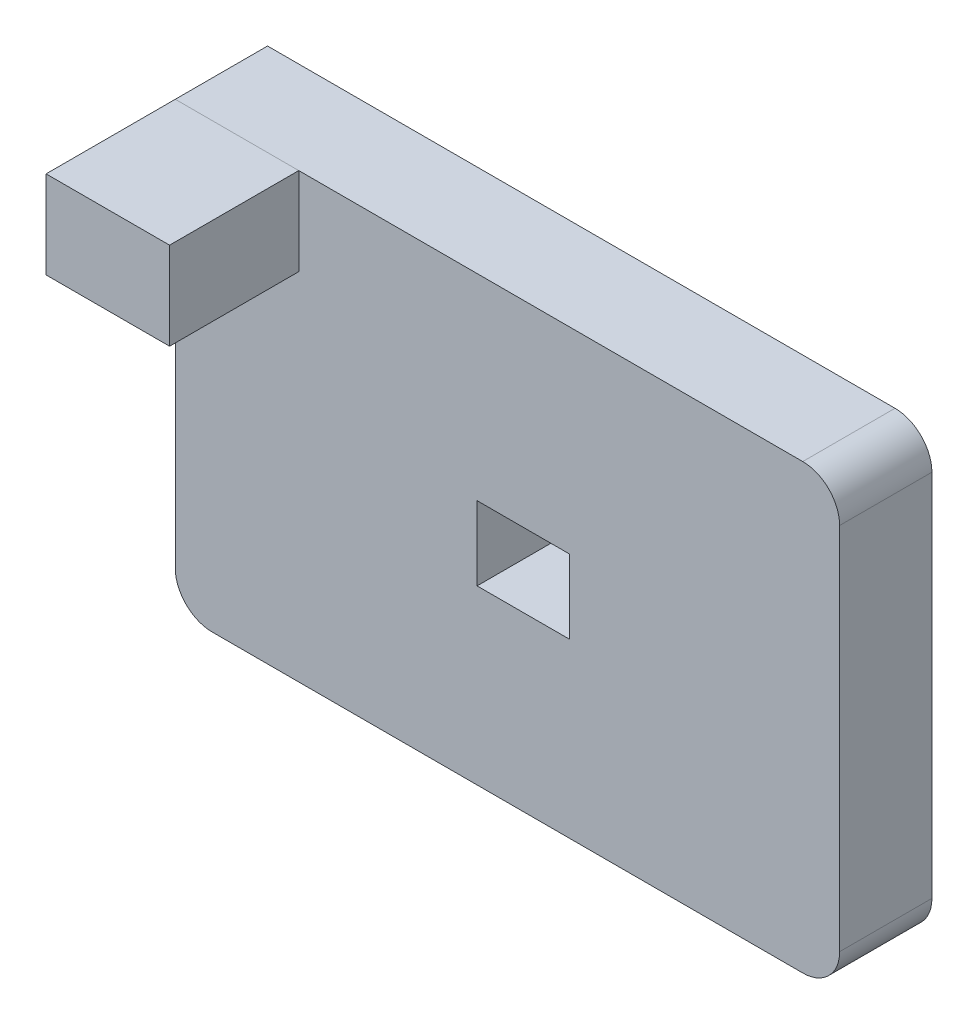
ISO-10303-21;
HEADER;
FILE_DESCRIPTION(('STEP AP214'),'2;1');
FILE_NAME('part.step','',(''),(''),'','','');
FILE_SCHEMA(('AUTOMOTIVE_DESIGN { 1 0 10303 214 1 1 1 1 }'));
ENDSEC;
DATA;
#1=APPLICATION_CONTEXT('core data for automotive mechanical design processes');
#2=APPLICATION_PROTOCOL_DEFINITION('international standard','automotive_design',2000,#1);
#3=PRODUCT_CONTEXT('',#1,'mechanical');
#4=PRODUCT('Part','Part','',(#3));
#5=PRODUCT_RELATED_PRODUCT_CATEGORY('part','',(#4));
#6=PRODUCT_DEFINITION_FORMATION('','',#4);
#7=PRODUCT_DEFINITION_CONTEXT('part definition',#1,'design');
#8=PRODUCT_DEFINITION('design','',#6,#7);
#9=PRODUCT_DEFINITION_SHAPE('','',#8);
#10=(LENGTH_UNIT() NAMED_UNIT(*) SI_UNIT(.MILLI.,.METRE.));
#11=(NAMED_UNIT(*) PLANE_ANGLE_UNIT() SI_UNIT($,.RADIAN.));
#12=(NAMED_UNIT(*) SI_UNIT($,.STERADIAN.) SOLID_ANGLE_UNIT());
#13=UNCERTAINTY_MEASURE_WITH_UNIT(LENGTH_MEASURE(1.E-05),#10,'distance_accuracy_value','');
#14=(GEOMETRIC_REPRESENTATION_CONTEXT(3) GLOBAL_UNCERTAINTY_ASSIGNED_CONTEXT((#13)) GLOBAL_UNIT_ASSIGNED_CONTEXT((#10,
#11,#12)) REPRESENTATION_CONTEXT('',''));
#15=CARTESIAN_POINT('',(0.,0.,0.));
#16=DIRECTION('',(0.,0.,1.));
#17=DIRECTION('',(1.,0.,0.));
#18=AXIS2_PLACEMENT_3D('',#15,#16,#17);
#19=CARTESIAN_POINT('',(0.,120.,60.));
#20=DIRECTION('',(1.,0.,0.));
#21=DIRECTION('',(0.,0.,-1.));
#22=AXIS2_PLACEMENT_3D('',#19,#20,#21);
#23=PLANE('',#22);
#24=DIRECTION('',(0.,-1.,0.));
#25=VECTOR('',#24,1.);
#26=CARTESIAN_POINT('',(0.,120.,25.));
#27=LINE('',#26,#25);
#28=CARTESIAN_POINT('',(0.,120.,25.));
#29=VERTEX_POINT('',#28);
#30=CARTESIAN_POINT('',(0.,96.2812155250226,25.));
#31=VERTEX_POINT('',#30);
#32=EDGE_CURVE('E136',#29,#31,#27,.T.);
#33=ORIENTED_EDGE('',*,*,#32,.T.);
#34=DIRECTION('',(0.,0.,-1.));
#35=VECTOR('',#34,1.);
#36=CARTESIAN_POINT('',(0.,96.2812155250226,60.));
#37=LINE('',#36,#35);
#38=CARTESIAN_POINT('',(0.,96.2812155250226,60.));
#39=VERTEX_POINT('',#38);
#40=EDGE_CURVE('E13',#39,#31,#37,.T.);
#41=ORIENTED_EDGE('',*,*,#40,.F.);
#42=DIRECTION('',(0.,-1.,0.));
#43=VECTOR('',#42,1.);
#44=CARTESIAN_POINT('',(0.,120.,60.));
#45=LINE('',#44,#43);
#46=CARTESIAN_POINT('',(0.,120.,60.));
#47=VERTEX_POINT('',#46);
#48=EDGE_CURVE('E124',#47,#39,#45,.T.);
#49=ORIENTED_EDGE('',*,*,#48,.F.);
#50=DIRECTION('',(0.,0.,-1.));
#51=VECTOR('',#50,1.);
#52=CARTESIAN_POINT('',(0.,120.,60.));
#53=LINE('',#52,#51);
#54=EDGE_CURVE('E132',#47,#29,#53,.T.);
#55=ORIENTED_EDGE('',*,*,#54,.T.);
#56=EDGE_LOOP('',(#33,#41,#49,#55));
#57=FACE_BOUND('',#56,.T.);
#58=ADVANCED_FACE('F73',(#57),#23,.F.);
#59=CARTESIAN_POINT('',(0.,96.2812155250226,60.));
#60=DIRECTION('',(0.,1.,0.));
#61=DIRECTION('',(0.,0.,1.));
#62=AXIS2_PLACEMENT_3D('',#59,#60,#61);
#63=PLANE('',#62);
#64=DIRECTION('',(1.,0.,0.));
#65=VECTOR('',#64,1.);
#66=CARTESIAN_POINT('',(0.,96.2812155250226,25.));
#67=LINE('',#66,#65);
#68=CARTESIAN_POINT('',(33.4578459350298,96.2812155250226,25.));
#69=VERTEX_POINT('',#68);
#70=EDGE_CURVE('E128',#31,#69,#67,.T.);
#71=ORIENTED_EDGE('',*,*,#70,.T.);
#72=DIRECTION('',(0.,0.,-1.));
#73=VECTOR('',#72,1.);
#74=CARTESIAN_POINT('',(33.4578459350298,96.2812155250226,60.));
#75=LINE('',#74,#73);
#76=CARTESIAN_POINT('',(33.4578459350298,96.2812155250226,60.));
#77=VERTEX_POINT('',#76);
#78=EDGE_CURVE('E81',#77,#69,#75,.T.);
#79=ORIENTED_EDGE('',*,*,#78,.F.);
#80=DIRECTION('',(1.,0.,0.));
#81=VECTOR('',#80,1.);
#82=CARTESIAN_POINT('',(0.,96.2812155250226,60.));
#83=LINE('',#82,#81);
#84=EDGE_CURVE('E119',#39,#77,#83,.T.);
#85=ORIENTED_EDGE('',*,*,#84,.F.);
#86=ORIENTED_EDGE('',*,*,#40,.T.);
#87=EDGE_LOOP('',(#71,#79,#85,#86));
#88=FACE_BOUND('',#87,.T.);
#89=ADVANCED_FACE('F127',(#88),#63,.F.);
#90=CARTESIAN_POINT('',(33.4578459350298,120.,60.));
#91=DIRECTION('',(-1.,0.,0.));
#92=DIRECTION('',(0.,0.,1.));
#93=AXIS2_PLACEMENT_3D('',#90,#91,#92);
#94=PLANE('',#93);
#95=DIRECTION('',(0.,1.,0.));
#96=VECTOR('',#95,1.);
#97=CARTESIAN_POINT('',(33.4578459350298,120.,25.));
#98=LINE('',#97,#96);
#99=CARTESIAN_POINT('',(33.4578459350298,120.,25.));
#100=VERTEX_POINT('',#99);
#101=EDGE_CURVE('E106',#69,#100,#98,.T.);
#102=ORIENTED_EDGE('',*,*,#101,.T.);
#103=DIRECTION('',(0.,0.,-1.));
#104=VECTOR('',#103,1.);
#105=CARTESIAN_POINT('',(33.4578459350298,120.,60.));
#106=LINE('',#105,#104);
#107=CARTESIAN_POINT('',(33.4578459350298,120.,60.));
#108=VERTEX_POINT('',#107);
#109=EDGE_CURVE('E129',#108,#100,#106,.T.);
#110=ORIENTED_EDGE('',*,*,#109,.F.);
#111=DIRECTION('',(0.,1.,0.));
#112=VECTOR('',#111,1.);
#113=CARTESIAN_POINT('',(33.4578459350298,120.,60.));
#114=LINE('',#113,#112);
#115=EDGE_CURVE('E122',#77,#108,#114,.T.);
#116=ORIENTED_EDGE('',*,*,#115,.F.);
#117=ORIENTED_EDGE('',*,*,#78,.T.);
#118=EDGE_LOOP('',(#102,#110,#116,#117));
#119=FACE_BOUND('',#118,.T.);
#120=ADVANCED_FACE('F130',(#119),#94,.F.);
#121=CARTESIAN_POINT('',(0.,120.,60.));
#122=DIRECTION('',(0.,-1.,0.));
#123=DIRECTION('',(0.,0.,-1.));
#124=AXIS2_PLACEMENT_3D('',#121,#122,#123);
#125=PLANE('',#124);
#126=DIRECTION('',(-1.,0.,0.));
#127=VECTOR('',#126,1.);
#128=CARTESIAN_POINT('',(0.,120.,25.));
#129=LINE('',#128,#127);
#130=EDGE_CURVE('E112',#100,#29,#129,.T.);
#131=ORIENTED_EDGE('',*,*,#130,.T.);
#132=ORIENTED_EDGE('',*,*,#54,.F.);
#133=DIRECTION('',(-1.,0.,0.));
#134=VECTOR('',#133,1.);
#135=CARTESIAN_POINT('',(0.,120.,60.));
#136=LINE('',#135,#134);
#137=EDGE_CURVE('E89',#108,#47,#136,.T.);
#138=ORIENTED_EDGE('',*,*,#137,.F.);
#139=ORIENTED_EDGE('',*,*,#109,.T.);
#140=EDGE_LOOP('',(#131,#132,#138,#139));
#141=FACE_BOUND('',#140,.T.);
#142=ADVANCED_FACE('F143',(#141),#125,.F.);
#143=CARTESIAN_POINT('',(0.,0.,60.));
#144=DIRECTION('',(0.,0.,1.));
#145=DIRECTION('',(1.,0.,0.));
#146=AXIS2_PLACEMENT_3D('',#143,#144,#145);
#147=PLANE('',#146);
#148=ORIENTED_EDGE('',*,*,#48,.T.);
#149=ORIENTED_EDGE('',*,*,#84,.T.);
#150=ORIENTED_EDGE('',*,*,#115,.T.);
#151=ORIENTED_EDGE('',*,*,#137,.T.);
#152=EDGE_LOOP('',(#148,#149,#150,#151));
#153=FACE_BOUND('',#152,.T.);
#154=ADVANCED_FACE('F120',(#153),#147,.T.);
#155=CARTESIAN_POINT('',(0.,0.,25.));
#156=DIRECTION('',(0.,0.,1.));
#157=DIRECTION('',(1.,0.,0.));
#158=AXIS2_PLACEMENT_3D('',#155,#156,#157);
#159=PLANE('',#158);
#160=ORIENTED_EDGE('',*,*,#32,.F.);
#161=ORIENTED_EDGE('',*,*,#130,.F.);
#162=ORIENTED_EDGE('',*,*,#101,.F.);
#163=ORIENTED_EDGE('',*,*,#70,.F.);
#164=EDGE_LOOP('',(#160,#161,#162,#163));
#165=FACE_BOUND('',#164,.T.);
#166=ADVANCED_FACE('F146',(#165),#159,.F.);
#167=CLOSED_SHELL('',(#58,#89,#120,#142,#154,#166));
#168=MANIFOLD_SOLID_BREP('B2',#167);
#169=CARTESIAN_POINT('',(0.,0.,25.));
#170=DIRECTION('',(0.,0.,1.));
#171=DIRECTION('',(1.,0.,0.));
#172=AXIS2_PLACEMENT_3D('',#169,#170,#171);
#173=PLANE('',#172);
#174=DIRECTION('',(0.,1.,0.));
#175=VECTOR('',#174,1.);
#176=CARTESIAN_POINT('',(180.,0.,25.));
#177=LINE('',#176,#175);
#178=CARTESIAN_POINT('',(180.,10.,25.));
#179=VERTEX_POINT('',#178);
#180=CARTESIAN_POINT('',(180.,110.,25.));
#181=VERTEX_POINT('',#180);
#182=EDGE_CURVE('E338',#179,#181,#177,.T.);
#183=ORIENTED_EDGE('',*,*,#182,.T.);
#184=CARTESIAN_POINT('',(170.,110.,25.));
#185=DIRECTION('',(0.,0.,1.));
#186=DIRECTION('',(1.,0.,0.));
#187=AXIS2_PLACEMENT_3D('',#184,#185,#186);
#188=CIRCLE('',#187,10.);
#189=CARTESIAN_POINT('',(170.,120.,25.));
#190=VERTEX_POINT('',#189);
#191=EDGE_CURVE('E390',#181,#190,#188,.T.);
#192=ORIENTED_EDGE('',*,*,#191,.T.);
#193=DIRECTION('',(1.,0.,0.));
#194=VECTOR('',#193,1.);
#195=CARTESIAN_POINT('',(0.,120.,25.));
#196=LINE('',#195,#194);
#197=CARTESIAN_POINT('',(0.,120.,25.));
#198=VERTEX_POINT('',#197);
#199=EDGE_CURVE('E334',#198,#190,#196,.T.);
#200=ORIENTED_EDGE('',*,*,#199,.F.);
#201=DIRECTION('',(0.,1.,0.));
#202=VECTOR('',#201,1.);
#203=CARTESIAN_POINT('',(0.,0.,25.));
#204=LINE('',#203,#202);
#205=CARTESIAN_POINT('',(0.,10.,25.));
#206=VERTEX_POINT('',#205);
#207=EDGE_CURVE('E346',#206,#198,#204,.T.);
#208=ORIENTED_EDGE('',*,*,#207,.F.);
#209=CARTESIAN_POINT('',(10.,10.,25.));
#210=DIRECTION('',(0.,0.,1.));
#211=DIRECTION('',(1.,0.,0.));
#212=AXIS2_PLACEMENT_3D('',#209,#210,#211);
#213=CIRCLE('',#212,10.);
#214=CARTESIAN_POINT('',(10.,0.,25.));
#215=VERTEX_POINT('',#214);
#216=EDGE_CURVE('E219',#206,#215,#213,.T.);
#217=ORIENTED_EDGE('',*,*,#216,.T.);
#218=DIRECTION('',(1.,0.,0.));
#219=VECTOR('',#218,1.);
#220=CARTESIAN_POINT('',(0.,0.,25.));
#221=LINE('',#220,#219);
#222=CARTESIAN_POINT('',(170.,0.,25.));
#223=VERTEX_POINT('',#222);
#224=EDGE_CURVE('E343',#215,#223,#221,.T.);
#225=ORIENTED_EDGE('',*,*,#224,.T.);
#226=CARTESIAN_POINT('',(170.,10.,25.));
#227=DIRECTION('',(0.,0.,1.));
#228=DIRECTION('',(1.,0.,0.));
#229=AXIS2_PLACEMENT_3D('',#226,#227,#228);
#230=CIRCLE('',#229,10.);
#231=EDGE_CURVE('E387',#223,#179,#230,.T.);
#232=ORIENTED_EDGE('',*,*,#231,.T.);
#233=EDGE_LOOP('',(#183,#192,#200,#208,#217,#225,#232));
#234=FACE_BOUND('',#233,.T.);
#235=DIRECTION('',(0.,-1.,0.));
#236=VECTOR('',#235,1.);
#237=CARTESIAN_POINT('',(106.773136821904,66.7107740720186,25.));
#238=LINE('',#237,#236);
#239=CARTESIAN_POINT('',(106.773136821904,66.7107740720186,25.));
#240=VERTEX_POINT('',#239);
#241=CARTESIAN_POINT('',(106.773136821904,46.7107740720186,25.));
#242=VERTEX_POINT('',#241);
#243=EDGE_CURVE('E292',#240,#242,#238,.T.);
#244=ORIENTED_EDGE('',*,*,#243,.T.);
#245=DIRECTION('',(1.,0.,0.));
#246=VECTOR('',#245,1.);
#247=CARTESIAN_POINT('',(81.7731368219036,46.7107740720186,25.));
#248=LINE('',#247,#246);
#249=CARTESIAN_POINT('',(81.7731368219036,46.7107740720186,25.));
#250=VERTEX_POINT('',#249);
#251=EDGE_CURVE('E281',#250,#242,#248,.T.);
#252=ORIENTED_EDGE('',*,*,#251,.F.);
#253=DIRECTION('',(0.,-1.,0.));
#254=VECTOR('',#253,1.);
#255=CARTESIAN_POINT('',(81.7731368219036,66.7107740720186,25.));
#256=LINE('',#255,#254);
#257=CARTESIAN_POINT('',(81.7731368219036,66.7107740720186,25.));
#258=VERTEX_POINT('',#257);
#259=EDGE_CURVE('E310',#258,#250,#256,.T.);
#260=ORIENTED_EDGE('',*,*,#259,.F.);
#261=DIRECTION('',(1.,0.,0.));
#262=VECTOR('',#261,1.);
#263=CARTESIAN_POINT('',(81.7731368219036,66.7107740720186,25.));
#264=LINE('',#263,#262);
#265=EDGE_CURVE('E306',#258,#240,#264,.T.);
#266=ORIENTED_EDGE('',*,*,#265,.T.);
#267=EDGE_LOOP('',(#244,#252,#260,#266));
#268=FACE_BOUND('',#267,.T.);
#269=ADVANCED_FACE('F197',(#234,#268),#173,.T.);
#270=CARTESIAN_POINT('',(0.,0.,0.));
#271=DIRECTION('',(0.,0.,1.));
#272=DIRECTION('',(1.,0.,0.));
#273=AXIS2_PLACEMENT_3D('',#270,#271,#272);
#274=PLANE('',#273);
#275=DIRECTION('',(1.,0.,0.));
#276=VECTOR('',#275,1.);
#277=CARTESIAN_POINT('',(0.,120.,0.));
#278=LINE('',#277,#276);
#279=CARTESIAN_POINT('',(0.,120.,0.));
#280=VERTEX_POINT('',#279);
#281=CARTESIAN_POINT('',(170.,120.,0.));
#282=VERTEX_POINT('',#281);
#283=EDGE_CURVE('E303',#280,#282,#278,.T.);
#284=ORIENTED_EDGE('',*,*,#283,.T.);
#285=CARTESIAN_POINT('',(170.,110.,0.));
#286=DIRECTION('',(0.,0.,1.));
#287=DIRECTION('',(1.,0.,0.));
#288=AXIS2_PLACEMENT_3D('',#285,#286,#287);
#289=CIRCLE('',#288,10.);
#290=CARTESIAN_POINT('',(180.,110.,0.));
#291=VERTEX_POINT('',#290);
#292=EDGE_CURVE('E375',#282,#291,#289,.F.);
#293=ORIENTED_EDGE('',*,*,#292,.T.);
#294=DIRECTION('',(0.,1.,0.));
#295=VECTOR('',#294,1.);
#296=CARTESIAN_POINT('',(180.,0.,0.));
#297=LINE('',#296,#295);
#298=CARTESIAN_POINT('',(180.,10.,0.));
#299=VERTEX_POINT('',#298);
#300=EDGE_CURVE('E353',#299,#291,#297,.T.);
#301=ORIENTED_EDGE('',*,*,#300,.F.);
#302=CARTESIAN_POINT('',(170.,10.,0.));
#303=DIRECTION('',(0.,0.,1.));
#304=DIRECTION('',(1.,0.,0.));
#305=AXIS2_PLACEMENT_3D('',#302,#303,#304);
#306=CIRCLE('',#305,10.);
#307=CARTESIAN_POINT('',(170.,0.,0.));
#308=VERTEX_POINT('',#307);
#309=EDGE_CURVE('E372',#299,#308,#306,.F.);
#310=ORIENTED_EDGE('',*,*,#309,.T.);
#311=DIRECTION('',(1.,0.,0.));
#312=VECTOR('',#311,1.);
#313=CARTESIAN_POINT('',(0.,0.,0.));
#314=LINE('',#313,#312);
#315=CARTESIAN_POINT('',(10.,0.,0.));
#316=VERTEX_POINT('',#315);
#317=EDGE_CURVE('E357',#316,#308,#314,.T.);
#318=ORIENTED_EDGE('',*,*,#317,.F.);
#319=CARTESIAN_POINT('',(10.,10.,0.));
#320=DIRECTION('',(0.,0.,1.));
#321=DIRECTION('',(1.,0.,0.));
#322=AXIS2_PLACEMENT_3D('',#319,#320,#321);
#323=CIRCLE('',#322,10.);
#324=CARTESIAN_POINT('',(0.,10.,0.));
#325=VERTEX_POINT('',#324);
#326=EDGE_CURVE('E369',#316,#325,#323,.F.);
#327=ORIENTED_EDGE('',*,*,#326,.T.);
#328=DIRECTION('',(0.,1.,0.));
#329=VECTOR('',#328,1.);
#330=CARTESIAN_POINT('',(0.,0.,0.));
#331=LINE('',#330,#329);
#332=EDGE_CURVE('E339',#325,#280,#331,.T.);
#333=ORIENTED_EDGE('',*,*,#332,.T.);
#334=EDGE_LOOP('',(#284,#293,#301,#310,#318,#327,#333));
#335=FACE_BOUND('',#334,.T.);
#336=DIRECTION('',(1.,0.,0.));
#337=VECTOR('',#336,1.);
#338=CARTESIAN_POINT('',(81.7731368219036,46.7107740720186,0.));
#339=LINE('',#338,#337);
#340=CARTESIAN_POINT('',(81.7731368219036,46.7107740720186,0.));
#341=VERTEX_POINT('',#340);
#342=CARTESIAN_POINT('',(106.773136821904,46.7107740720186,0.));
#343=VERTEX_POINT('',#342);
#344=EDGE_CURVE('E315',#341,#343,#339,.T.);
#345=ORIENTED_EDGE('',*,*,#344,.T.);
#346=DIRECTION('',(0.,-1.,0.));
#347=VECTOR('',#346,1.);
#348=CARTESIAN_POINT('',(106.773136821904,66.7107740720186,0.));
#349=LINE('',#348,#347);
#350=CARTESIAN_POINT('',(106.773136821904,66.7107740720186,0.));
#351=VERTEX_POINT('',#350);
#352=EDGE_CURVE('E300',#351,#343,#349,.T.);
#353=ORIENTED_EDGE('',*,*,#352,.F.);
#354=DIRECTION('',(1.,0.,0.));
#355=VECTOR('',#354,1.);
#356=CARTESIAN_POINT('',(81.7731368219036,66.7107740720186,0.));
#357=LINE('',#356,#355);
#358=CARTESIAN_POINT('',(81.7731368219036,66.7107740720186,0.));
#359=VERTEX_POINT('',#358);
#360=EDGE_CURVE('E320',#359,#351,#357,.T.);
#361=ORIENTED_EDGE('',*,*,#360,.F.);
#362=DIRECTION('',(0.,-1.,0.));
#363=VECTOR('',#362,1.);
#364=CARTESIAN_POINT('',(81.7731368219036,66.7107740720186,0.));
#365=LINE('',#364,#363);
#366=EDGE_CURVE('E293',#359,#341,#365,.T.);
#367=ORIENTED_EDGE('',*,*,#366,.T.);
#368=EDGE_LOOP('',(#345,#353,#361,#367));
#369=FACE_BOUND('',#368,.T.);
#370=ADVANCED_FACE('F402',(#335,#369),#274,.F.);
#371=CARTESIAN_POINT('',(0.,120.,25.));
#372=DIRECTION('',(0.,1.,0.));
#373=DIRECTION('',(0.,0.,1.));
#374=AXIS2_PLACEMENT_3D('',#371,#372,#373);
#375=PLANE('',#374);
#376=ORIENTED_EDGE('',*,*,#199,.T.);
#377=DIRECTION('',(0.,0.,-1.));
#378=VECTOR('',#377,1.);
#379=CARTESIAN_POINT('',(170.,120.,0.));
#380=LINE('',#379,#378);
#381=EDGE_CURVE('E365',#190,#282,#380,.T.);
#382=ORIENTED_EDGE('',*,*,#381,.T.);
#383=ORIENTED_EDGE('',*,*,#283,.F.);
#384=DIRECTION('',(0.,0.,-1.));
#385=VECTOR('',#384,1.);
#386=CARTESIAN_POINT('',(0.,120.,25.));
#387=LINE('',#386,#385);
#388=EDGE_CURVE('E349',#198,#280,#387,.T.);
#389=ORIENTED_EDGE('',*,*,#388,.F.);
#390=EDGE_LOOP('',(#376,#382,#383,#389));
#391=FACE_BOUND('',#390,.T.);
#392=ADVANCED_FACE('F421',(#391),#375,.T.);
#393=CARTESIAN_POINT('',(0.,0.,25.));
#394=DIRECTION('',(-1.,0.,0.));
#395=DIRECTION('',(0.,0.,1.));
#396=AXIS2_PLACEMENT_3D('',#393,#394,#395);
#397=PLANE('',#396);
#398=ORIENTED_EDGE('',*,*,#332,.F.);
#399=DIRECTION('',(0.,0.,-1.));
#400=VECTOR('',#399,1.);
#401=CARTESIAN_POINT('',(0.,10.,25.));
#402=LINE('',#401,#400);
#403=EDGE_CURVE('E71',#325,#206,#402,.F.);
#404=ORIENTED_EDGE('',*,*,#403,.T.);
#405=ORIENTED_EDGE('',*,*,#207,.T.);
#406=ORIENTED_EDGE('',*,*,#388,.T.);
#407=EDGE_LOOP('',(#398,#404,#405,#406));
#408=FACE_BOUND('',#407,.T.);
#409=ADVANCED_FACE('F425',(#408),#397,.T.);
#410=CARTESIAN_POINT('',(0.,0.,25.));
#411=DIRECTION('',(0.,1.,0.));
#412=DIRECTION('',(0.,0.,1.));
#413=AXIS2_PLACEMENT_3D('',#410,#411,#412);
#414=PLANE('',#413);
#415=ORIENTED_EDGE('',*,*,#317,.T.);
#416=DIRECTION('',(0.,0.,-1.));
#417=VECTOR('',#416,1.);
#418=CARTESIAN_POINT('',(170.,0.,25.));
#419=LINE('',#418,#417);
#420=EDGE_CURVE('E206',#308,#223,#419,.F.);
#421=ORIENTED_EDGE('',*,*,#420,.T.);
#422=ORIENTED_EDGE('',*,*,#224,.F.);
#423=DIRECTION('',(0.,0.,-1.));
#424=VECTOR('',#423,1.);
#425=CARTESIAN_POINT('',(10.,0.,0.));
#426=LINE('',#425,#424);
#427=EDGE_CURVE('E393',#215,#316,#426,.T.);
#428=ORIENTED_EDGE('',*,*,#427,.T.);
#429=EDGE_LOOP('',(#415,#421,#422,#428));
#430=FACE_BOUND('',#429,.T.);
#431=ADVANCED_FACE('F399',(#430),#414,.F.);
#432=CARTESIAN_POINT('',(180.,0.,25.));
#433=DIRECTION('',(-1.,0.,0.));
#434=DIRECTION('',(0.,0.,1.));
#435=AXIS2_PLACEMENT_3D('',#432,#433,#434);
#436=PLANE('',#435);
#437=ORIENTED_EDGE('',*,*,#300,.T.);
#438=DIRECTION('',(0.,0.,-1.));
#439=VECTOR('',#438,1.);
#440=CARTESIAN_POINT('',(180.,110.,25.));
#441=LINE('',#440,#439);
#442=EDGE_CURVE('E382',#291,#181,#441,.F.);
#443=ORIENTED_EDGE('',*,*,#442,.T.);
#444=ORIENTED_EDGE('',*,*,#182,.F.);
#445=DIRECTION('',(0.,0.,-1.));
#446=VECTOR('',#445,1.);
#447=CARTESIAN_POINT('',(180.,10.,25.));
#448=LINE('',#447,#446);
#449=EDGE_CURVE('E378',#179,#299,#448,.T.);
#450=ORIENTED_EDGE('',*,*,#449,.T.);
#451=EDGE_LOOP('',(#437,#443,#444,#450));
#452=FACE_BOUND('',#451,.T.);
#453=ADVANCED_FACE('F412',(#452),#436,.F.);
#454=CARTESIAN_POINT('',(81.7731368219036,46.7107740720186,25.));
#455=DIRECTION('',(0.,1.,0.));
#456=DIRECTION('',(0.,0.,1.));
#457=AXIS2_PLACEMENT_3D('',#454,#455,#456);
#458=PLANE('',#457);
#459=ORIENTED_EDGE('',*,*,#344,.F.);
#460=DIRECTION('',(0.,0.,-1.));
#461=VECTOR('',#460,1.);
#462=CARTESIAN_POINT('',(81.7731368219036,46.7107740720186,25.));
#463=LINE('',#462,#461);
#464=EDGE_CURVE('E287',#250,#341,#463,.T.);
#465=ORIENTED_EDGE('',*,*,#464,.F.);
#466=ORIENTED_EDGE('',*,*,#251,.T.);
#467=DIRECTION('',(0.,0.,-1.));
#468=VECTOR('',#467,1.);
#469=CARTESIAN_POINT('',(106.773136821904,46.7107740720186,25.));
#470=LINE('',#469,#468);
#471=EDGE_CURVE('E284',#242,#343,#470,.T.);
#472=ORIENTED_EDGE('',*,*,#471,.T.);
#473=EDGE_LOOP('',(#459,#465,#466,#472));
#474=FACE_BOUND('',#473,.T.);
#475=ADVANCED_FACE('F283',(#474),#458,.T.);
#476=CARTESIAN_POINT('',(106.773136821904,66.7107740720186,25.));
#477=DIRECTION('',(1.,0.,0.));
#478=DIRECTION('',(0.,0.,-1.));
#479=AXIS2_PLACEMENT_3D('',#476,#477,#478);
#480=PLANE('',#479);
#481=ORIENTED_EDGE('',*,*,#352,.T.);
#482=ORIENTED_EDGE('',*,*,#471,.F.);
#483=ORIENTED_EDGE('',*,*,#243,.F.);
#484=DIRECTION('',(0.,0.,-1.));
#485=VECTOR('',#484,1.);
#486=CARTESIAN_POINT('',(106.773136821904,66.7107740720186,25.));
#487=LINE('',#486,#485);
#488=EDGE_CURVE('E304',#240,#351,#487,.T.);
#489=ORIENTED_EDGE('',*,*,#488,.T.);
#490=EDGE_LOOP('',(#481,#482,#483,#489));
#491=FACE_BOUND('',#490,.T.);
#492=ADVANCED_FACE('F297',(#491),#480,.F.);
#493=CARTESIAN_POINT('',(81.7731368219036,66.7107740720186,25.));
#494=DIRECTION('',(0.,1.,0.));
#495=DIRECTION('',(0.,0.,1.));
#496=AXIS2_PLACEMENT_3D('',#493,#494,#495);
#497=PLANE('',#496);
#498=ORIENTED_EDGE('',*,*,#360,.T.);
#499=ORIENTED_EDGE('',*,*,#488,.F.);
#500=ORIENTED_EDGE('',*,*,#265,.F.);
#501=DIRECTION('',(0.,0.,-1.));
#502=VECTOR('',#501,1.);
#503=CARTESIAN_POINT('',(81.7731368219036,66.7107740720186,25.));
#504=LINE('',#503,#502);
#505=EDGE_CURVE('E329',#258,#359,#504,.T.);
#506=ORIENTED_EDGE('',*,*,#505,.T.);
#507=EDGE_LOOP('',(#498,#499,#500,#506));
#508=FACE_BOUND('',#507,.T.);
#509=ADVANCED_FACE('F452',(#508),#497,.F.);
#510=CARTESIAN_POINT('',(81.7731368219036,66.7107740720186,25.));
#511=DIRECTION('',(1.,0.,0.));
#512=DIRECTION('',(0.,1.,0.));
#513=AXIS2_PLACEMENT_3D('',#510,#511,#512);
#514=PLANE('',#513);
#515=ORIENTED_EDGE('',*,*,#366,.F.);
#516=ORIENTED_EDGE('',*,*,#505,.F.);
#517=ORIENTED_EDGE('',*,*,#259,.T.);
#518=ORIENTED_EDGE('',*,*,#464,.T.);
#519=EDGE_LOOP('',(#515,#516,#517,#518));
#520=FACE_BOUND('',#519,.T.);
#521=ADVANCED_FACE('F448',(#520),#514,.T.);
#522=CARTESIAN_POINT('',(170.,110.,25.));
#523=DIRECTION('',(0.,0.,1.));
#524=DIRECTION('',(1.,0.,0.));
#525=AXIS2_PLACEMENT_3D('',#522,#523,#524);
#526=CYLINDRICAL_SURFACE('',#525,10.);
#527=ORIENTED_EDGE('',*,*,#191,.F.);
#528=ORIENTED_EDGE('',*,*,#442,.F.);
#529=ORIENTED_EDGE('',*,*,#292,.F.);
#530=ORIENTED_EDGE('',*,*,#381,.F.);
#531=EDGE_LOOP('',(#527,#528,#529,#530));
#532=FACE_BOUND('',#531,.T.);
#533=ADVANCED_FACE('F418',(#532),#526,.T.);
#534=CARTESIAN_POINT('',(170.,10.,25.));
#535=DIRECTION('',(0.,0.,-1.));
#536=DIRECTION('',(-1.,0.,0.));
#537=AXIS2_PLACEMENT_3D('',#534,#535,#536);
#538=CYLINDRICAL_SURFACE('',#537,10.);
#539=ORIENTED_EDGE('',*,*,#231,.F.);
#540=ORIENTED_EDGE('',*,*,#420,.F.);
#541=ORIENTED_EDGE('',*,*,#309,.F.);
#542=ORIENTED_EDGE('',*,*,#449,.F.);
#543=EDGE_LOOP('',(#539,#540,#541,#542));
#544=FACE_BOUND('',#543,.T.);
#545=ADVANCED_FACE('F409',(#544),#538,.T.);
#546=CARTESIAN_POINT('',(10.,10.,25.));
#547=DIRECTION('',(0.,0.,1.));
#548=DIRECTION('',(1.,0.,0.));
#549=AXIS2_PLACEMENT_3D('',#546,#547,#548);
#550=CYLINDRICAL_SURFACE('',#549,10.);
#551=ORIENTED_EDGE('',*,*,#216,.F.);
#552=ORIENTED_EDGE('',*,*,#403,.F.);
#553=ORIENTED_EDGE('',*,*,#326,.F.);
#554=ORIENTED_EDGE('',*,*,#427,.F.);
#555=EDGE_LOOP('',(#551,#552,#553,#554));
#556=FACE_BOUND('',#555,.T.);
#557=ADVANCED_FACE('F199',(#556),#550,.T.);
#558=CLOSED_SHELL('',(#269,#370,#392,#409,#431,#453,#475,#492,#509,#521,#533,#545,#557));
#559=MANIFOLD_SOLID_BREP('B7',#558);
#560=ADVANCED_BREP_SHAPE_REPRESENTATION('',(#18,#168,#559),#14);
#561=SHAPE_DEFINITION_REPRESENTATION(#9,#560);
ENDSEC;
END-ISO-10303-21;
